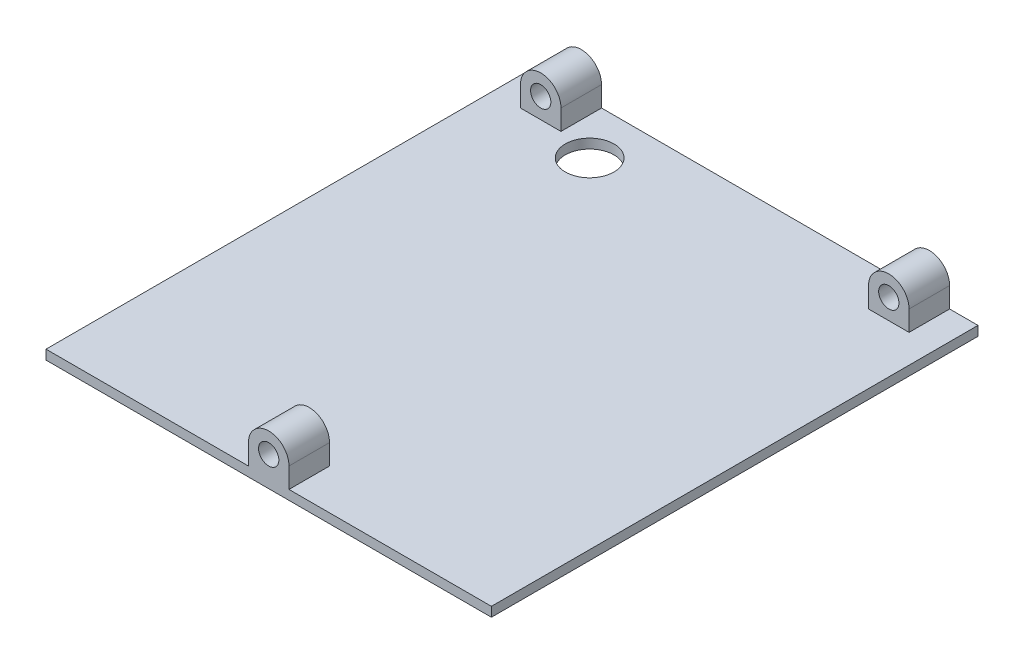
ISO-10303-21;
HEADER;
FILE_DESCRIPTION(('STEP AP214'),'2;1');
FILE_NAME('part.step','',(''),(''),'','','');
FILE_SCHEMA(('AUTOMOTIVE_DESIGN { 1 0 10303 214 1 1 1 1 }'));
ENDSEC;
DATA;
#1=APPLICATION_CONTEXT('core data for automotive mechanical design processes');
#2=APPLICATION_PROTOCOL_DEFINITION('international standard','automotive_design',2000,#1);
#3=PRODUCT_CONTEXT('',#1,'mechanical');
#4=PRODUCT('Part','Part','',(#3));
#5=PRODUCT_RELATED_PRODUCT_CATEGORY('part','',(#4));
#6=PRODUCT_DEFINITION_FORMATION('','',#4);
#7=PRODUCT_DEFINITION_CONTEXT('part definition',#1,'design');
#8=PRODUCT_DEFINITION('design','',#6,#7);
#9=PRODUCT_DEFINITION_SHAPE('','',#8);
#10=(LENGTH_UNIT() NAMED_UNIT(*) SI_UNIT(.MILLI.,.METRE.));
#11=(NAMED_UNIT(*) PLANE_ANGLE_UNIT() SI_UNIT($,.RADIAN.));
#12=(NAMED_UNIT(*) SI_UNIT($,.STERADIAN.) SOLID_ANGLE_UNIT());
#13=UNCERTAINTY_MEASURE_WITH_UNIT(LENGTH_MEASURE(1.E-05),#10,'distance_accuracy_value','');
#14=(GEOMETRIC_REPRESENTATION_CONTEXT(3) GLOBAL_UNCERTAINTY_ASSIGNED_CONTEXT((#13)) GLOBAL_UNIT_ASSIGNED_CONTEXT((#10,
#11,#12)) REPRESENTATION_CONTEXT('',''));
#15=CARTESIAN_POINT('',(0.,0.,0.));
#16=DIRECTION('',(0.,0.,1.));
#17=DIRECTION('',(1.,0.,0.));
#18=AXIS2_PLACEMENT_3D('',#15,#16,#17);
#19=CARTESIAN_POINT('',(0.,6.35,0.));
#20=DIRECTION('',(1.,0.,0.));
#21=DIRECTION('',(0.,0.,-1.));
#22=AXIS2_PLACEMENT_3D('',#19,#20,#21);
#23=PLANE('',#22);
#24=DIRECTION('',(0.,0.,1.));
#25=VECTOR('',#24,1.);
#26=CARTESIAN_POINT('',(0.,2.975,-152.4));
#27=LINE('',#26,#25);
#28=CARTESIAN_POINT('',(0.,2.975,-152.4));
#29=VERTEX_POINT('',#28);
#30=CARTESIAN_POINT('',(0.,2.975,0.));
#31=VERTEX_POINT('',#30);
#32=EDGE_CURVE('E290',#29,#31,#27,.T.);
#33=ORIENTED_EDGE('',*,*,#32,.F.);
#34=DIRECTION('',(0.,-1.,0.));
#35=VECTOR('',#34,1.);
#36=CARTESIAN_POINT('',(0.,6.35,-152.4));
#37=LINE('',#36,#35);
#38=CARTESIAN_POINT('',(0.,0.,-152.4));
#39=VERTEX_POINT('',#38);
#40=EDGE_CURVE('E331',#29,#39,#37,.T.);
#41=ORIENTED_EDGE('',*,*,#40,.T.);
#42=DIRECTION('',(0.,0.,1.));
#43=VECTOR('',#42,1.);
#44=CARTESIAN_POINT('',(0.,0.,0.));
#45=LINE('',#44,#43);
#46=CARTESIAN_POINT('',(0.,0.,0.));
#47=VERTEX_POINT('',#46);
#48=EDGE_CURVE('E314',#39,#47,#45,.T.);
#49=ORIENTED_EDGE('',*,*,#48,.T.);
#50=DIRECTION('',(0.,-1.,0.));
#51=VECTOR('',#50,1.);
#52=CARTESIAN_POINT('',(0.,6.35,0.));
#53=LINE('',#52,#51);
#54=EDGE_CURVE('E11',#31,#47,#53,.T.);
#55=ORIENTED_EDGE('',*,*,#54,.F.);
#56=EDGE_LOOP('',(#33,#41,#49,#55));
#57=FACE_BOUND('',#56,.T.);
#58=ADVANCED_FACE('F39',(#57),#23,.F.);
#59=CARTESIAN_POINT('',(0.,6.35,0.));
#60=DIRECTION('',(0.,0.,-1.));
#61=DIRECTION('',(-1.,0.,0.));
#62=AXIS2_PLACEMENT_3D('',#59,#60,#61);
#63=PLANE('',#62);
#64=DIRECTION('',(1.,0.,0.));
#65=VECTOR('',#64,1.);
#66=CARTESIAN_POINT('',(0.,2.975,0.));
#67=LINE('',#66,#65);
#68=CARTESIAN_POINT('',(63.4,2.975,0.));
#69=VERTEX_POINT('',#68);
#70=EDGE_CURVE('E303',#31,#69,#67,.T.);
#71=ORIENTED_EDGE('',*,*,#70,.F.);
#72=ORIENTED_EDGE('',*,*,#54,.T.);
#73=DIRECTION('',(1.,0.,0.));
#74=VECTOR('',#73,1.);
#75=CARTESIAN_POINT('',(0.,0.,0.));
#76=LINE('',#75,#74);
#77=CARTESIAN_POINT('',(139.5,0.,0.));
#78=VERTEX_POINT('',#77);
#79=EDGE_CURVE('E319',#47,#78,#76,.T.);
#80=ORIENTED_EDGE('',*,*,#79,.T.);
#81=DIRECTION('',(0.,-1.,0.));
#82=VECTOR('',#81,1.);
#83=CARTESIAN_POINT('',(139.5,6.35,0.));
#84=LINE('',#83,#82);
#85=CARTESIAN_POINT('',(139.5,2.975,0.));
#86=VERTEX_POINT('',#85);
#87=EDGE_CURVE('E48',#86,#78,#84,.T.);
#88=ORIENTED_EDGE('',*,*,#87,.F.);
#89=CARTESIAN_POINT('',(76.1,2.975,0.));
#90=VERTEX_POINT('',#89);
#91=EDGE_CURVE('E302',#90,#86,#67,.T.);
#92=ORIENTED_EDGE('',*,*,#91,.F.);
#93=DIRECTION('',(0.,1.,0.));
#94=VECTOR('',#93,1.);
#95=CARTESIAN_POINT('',(76.1,9.32500063341215,0.));
#96=LINE('',#95,#94);
#97=CARTESIAN_POINT('',(76.1,9.32500063341215,0.));
#98=VERTEX_POINT('',#97);
#99=EDGE_CURVE('E264',#90,#98,#96,.T.);
#100=ORIENTED_EDGE('',*,*,#99,.T.);
#101=CARTESIAN_POINT('',(69.75,9.32500031670607,0.));
#102=DIRECTION('',(0.,0.,1.));
#103=DIRECTION('',(1.,0.,0.));
#104=AXIS2_PLACEMENT_3D('',#101,#102,#103);
#105=CIRCLE('',#104,6.35);
#106=CARTESIAN_POINT('',(63.4,9.325,0.));
#107=VERTEX_POINT('',#106);
#108=EDGE_CURVE('E255',#98,#107,#105,.T.);
#109=ORIENTED_EDGE('',*,*,#108,.T.);
#110=DIRECTION('',(0.,-1.,0.));
#111=VECTOR('',#110,1.);
#112=CARTESIAN_POINT('',(63.4,9.325,0.));
#113=LINE('',#112,#111);
#114=EDGE_CURVE('E280',#107,#69,#113,.T.);
#115=ORIENTED_EDGE('',*,*,#114,.T.);
#116=EDGE_LOOP('',(#71,#72,#80,#88,#92,#100,#109,#115));
#117=FACE_BOUND('',#116,.T.);
#118=CARTESIAN_POINT('',(69.75,9.32500031670607,0.));
#119=DIRECTION('',(0.,0.,1.));
#120=DIRECTION('',(1.,0.,0.));
#121=AXIS2_PLACEMENT_3D('',#118,#119,#120);
#122=CIRCLE('',#121,3.17499999999998);
#123=CARTESIAN_POINT('',(72.925,9.32500031670607,0.));
#124=VERTEX_POINT('',#123);
#125=EDGE_CURVE('E240',#124,#124,#122,.T.);
#126=ORIENTED_EDGE('',*,*,#125,.F.);
#127=EDGE_LOOP('',(#126));
#128=FACE_BOUND('',#127,.T.);
#129=ADVANCED_FACE('F349',(#117,#128),#63,.F.);
#130=CARTESIAN_POINT('',(139.5,6.35,0.));
#131=DIRECTION('',(-1.,0.,0.));
#132=DIRECTION('',(0.,0.,1.));
#133=AXIS2_PLACEMENT_3D('',#130,#131,#132);
#134=PLANE('',#133);
#135=DIRECTION('',(0.,0.,-1.));
#136=VECTOR('',#135,1.);
#137=CARTESIAN_POINT('',(139.5,2.975,-152.4));
#138=LINE('',#137,#136);
#139=CARTESIAN_POINT('',(139.5,2.975,-152.4));
#140=VERTEX_POINT('',#139);
#141=EDGE_CURVE('E307',#86,#140,#138,.T.);
#142=ORIENTED_EDGE('',*,*,#141,.F.);
#143=ORIENTED_EDGE('',*,*,#87,.T.);
#144=DIRECTION('',(0.,0.,-1.));
#145=VECTOR('',#144,1.);
#146=CARTESIAN_POINT('',(139.5,0.,0.));
#147=LINE('',#146,#145);
#148=CARTESIAN_POINT('',(139.5,0.,-152.4));
#149=VERTEX_POINT('',#148);
#150=EDGE_CURVE('E323',#78,#149,#147,.T.);
#151=ORIENTED_EDGE('',*,*,#150,.T.);
#152=DIRECTION('',(0.,-1.,0.));
#153=VECTOR('',#152,1.);
#154=CARTESIAN_POINT('',(139.5,6.35,-152.4));
#155=LINE('',#154,#153);
#156=EDGE_CURVE('E334',#140,#149,#155,.T.);
#157=ORIENTED_EDGE('',*,*,#156,.F.);
#158=EDGE_LOOP('',(#142,#143,#151,#157));
#159=FACE_BOUND('',#158,.T.);
#160=ADVANCED_FACE('F341',(#159),#134,.F.);
#161=CARTESIAN_POINT('',(0.,6.35,-152.4));
#162=DIRECTION('',(0.,0.,1.));
#163=DIRECTION('',(1.,0.,0.));
#164=AXIS2_PLACEMENT_3D('',#161,#162,#163);
#165=PLANE('',#164);
#166=DIRECTION('',(-1.,0.,0.));
#167=VECTOR('',#166,1.);
#168=CARTESIAN_POINT('',(0.,2.975,-152.4));
#169=LINE('',#168,#167);
#170=CARTESIAN_POINT('',(130.61,2.975,-152.4));
#171=VERTEX_POINT('',#170);
#172=EDGE_CURVE('E311',#140,#171,#169,.T.);
#173=ORIENTED_EDGE('',*,*,#172,.F.);
#174=ORIENTED_EDGE('',*,*,#156,.T.);
#175=DIRECTION('',(-1.,0.,0.));
#176=VECTOR('',#175,1.);
#177=CARTESIAN_POINT('',(0.,0.,-152.4));
#178=LINE('',#177,#176);
#179=EDGE_CURVE('E327',#149,#39,#178,.T.);
#180=ORIENTED_EDGE('',*,*,#179,.T.);
#181=ORIENTED_EDGE('',*,*,#40,.F.);
#182=CARTESIAN_POINT('',(8.89,2.975,-152.4));
#183=VERTEX_POINT('',#182);
#184=EDGE_CURVE('E310',#183,#29,#169,.T.);
#185=ORIENTED_EDGE('',*,*,#184,.F.);
#186=DIRECTION('',(0.,1.,0.));
#187=VECTOR('',#186,1.);
#188=CARTESIAN_POINT('',(8.89,9.325,-152.4));
#189=LINE('',#188,#187);
#190=CARTESIAN_POINT('',(8.89,9.325,-152.4));
#191=VERTEX_POINT('',#190);
#192=EDGE_CURVE('E175',#183,#191,#189,.T.);
#193=ORIENTED_EDGE('',*,*,#192,.T.);
#194=CARTESIAN_POINT('',(15.24,9.325,-152.4));
#195=DIRECTION('',(0.,0.,-1.));
#196=DIRECTION('',(-1.,0.,0.));
#197=AXIS2_PLACEMENT_3D('',#194,#195,#196);
#198=CIRCLE('',#197,6.35);
#199=CARTESIAN_POINT('',(21.59,9.325,-152.4));
#200=VERTEX_POINT('',#199);
#201=EDGE_CURVE('E188',#191,#200,#198,.T.);
#202=ORIENTED_EDGE('',*,*,#201,.T.);
#203=DIRECTION('',(0.,-1.,0.));
#204=VECTOR('',#203,1.);
#205=CARTESIAN_POINT('',(21.59,9.325,-152.4));
#206=LINE('',#205,#204);
#207=CARTESIAN_POINT('',(21.59,2.975,-152.4));
#208=VERTEX_POINT('',#207);
#209=EDGE_CURVE('E156',#200,#208,#206,.T.);
#210=ORIENTED_EDGE('',*,*,#209,.T.);
#211=CARTESIAN_POINT('',(117.91,2.975,-152.4));
#212=VERTEX_POINT('',#211);
#213=EDGE_CURVE('E315',#212,#208,#169,.T.);
#214=ORIENTED_EDGE('',*,*,#213,.F.);
#215=DIRECTION('',(0.,1.,0.));
#216=VECTOR('',#215,1.);
#217=CARTESIAN_POINT('',(117.91,9.325,-152.4));
#218=LINE('',#217,#216);
#219=CARTESIAN_POINT('',(117.91,9.325,-152.4));
#220=VERTEX_POINT('',#219);
#221=EDGE_CURVE('E215',#212,#220,#218,.T.);
#222=ORIENTED_EDGE('',*,*,#221,.T.);
#223=CARTESIAN_POINT('',(124.26,9.325,-152.4));
#224=DIRECTION('',(0.,0.,-1.));
#225=DIRECTION('',(-1.,0.,0.));
#226=AXIS2_PLACEMENT_3D('',#223,#224,#225);
#227=CIRCLE('',#226,6.35);
#228=CARTESIAN_POINT('',(130.61,9.325,-152.4));
#229=VERTEX_POINT('',#228);
#230=EDGE_CURVE('E206',#220,#229,#227,.T.);
#231=ORIENTED_EDGE('',*,*,#230,.T.);
#232=DIRECTION('',(0.,-1.,0.));
#233=VECTOR('',#232,1.);
#234=CARTESIAN_POINT('',(130.61,9.325,-152.4));
#235=LINE('',#234,#233);
#236=EDGE_CURVE('E230',#229,#171,#235,.T.);
#237=ORIENTED_EDGE('',*,*,#236,.T.);
#238=EDGE_LOOP('',(#173,#174,#180,#181,#185,#193,#202,#210,#214,#222,#231,#237));
#239=FACE_BOUND('',#238,.T.);
#240=CARTESIAN_POINT('',(124.26,9.325,-152.4));
#241=DIRECTION('',(0.,0.,-1.));
#242=DIRECTION('',(-1.,0.,0.));
#243=AXIS2_PLACEMENT_3D('',#240,#241,#242);
#244=CIRCLE('',#243,3.17500000072341);
#245=CARTESIAN_POINT('',(121.084999999277,9.325,-152.4));
#246=VERTEX_POINT('',#245);
#247=EDGE_CURVE('E196',#246,#246,#244,.T.);
#248=ORIENTED_EDGE('',*,*,#247,.F.);
#249=EDGE_LOOP('',(#248));
#250=FACE_BOUND('',#249,.T.);
#251=CARTESIAN_POINT('',(15.24,9.325,-152.4));
#252=DIRECTION('',(0.,0.,-1.));
#253=DIRECTION('',(-1.,0.,0.));
#254=AXIS2_PLACEMENT_3D('',#251,#252,#253);
#255=CIRCLE('',#254,3.17500000036169);
#256=CARTESIAN_POINT('',(12.0649999996383,9.325,-152.4));
#257=VERTEX_POINT('',#256);
#258=EDGE_CURVE('E181',#257,#257,#255,.T.);
#259=ORIENTED_EDGE('',*,*,#258,.F.);
#260=EDGE_LOOP('',(#259));
#261=FACE_BOUND('',#260,.T.);
#262=ADVANCED_FACE('F358',(#239,#250,#261),#165,.F.);
#263=CARTESIAN_POINT('',(0.,0.,0.));
#264=DIRECTION('',(0.,-1.,0.));
#265=DIRECTION('',(0.,0.,-1.));
#266=AXIS2_PLACEMENT_3D('',#263,#264,#265);
#267=PLANE('',#266);
#268=CARTESIAN_POINT('',(33.274,0.,-136.991598));
#269=DIRECTION('',(0.,-1.,0.));
#270=DIRECTION('',(0.,0.,-1.));
#271=AXIS2_PLACEMENT_3D('',#268,#269,#270);
#272=CIRCLE('',#271,7.62);
#273=CARTESIAN_POINT('',(33.274,0.,-144.611598));
#274=VERTEX_POINT('',#273);
#275=EDGE_CURVE('E457',#274,#274,#272,.T.);
#276=ORIENTED_EDGE('',*,*,#275,.F.);
#277=EDGE_LOOP('',(#276));
#278=FACE_BOUND('',#277,.T.);
#279=ORIENTED_EDGE('',*,*,#48,.F.);
#280=ORIENTED_EDGE('',*,*,#179,.F.);
#281=ORIENTED_EDGE('',*,*,#150,.F.);
#282=ORIENTED_EDGE('',*,*,#79,.F.);
#283=EDGE_LOOP('',(#279,#280,#281,#282));
#284=FACE_BOUND('',#283,.T.);
#285=ADVANCED_FACE('F354',(#278,#284),#267,.T.);
#286=CARTESIAN_POINT('',(0.,2.975,0.));
#287=DIRECTION('',(0.,1.,0.));
#288=DIRECTION('',(0.,0.,1.));
#289=AXIS2_PLACEMENT_3D('',#286,#287,#288);
#290=PLANE('',#289);
#291=CARTESIAN_POINT('',(33.274,2.975,-136.991598));
#292=DIRECTION('',(0.,1.,0.));
#293=DIRECTION('',(0.,0.,1.));
#294=AXIS2_PLACEMENT_3D('',#291,#292,#293);
#295=CIRCLE('',#294,7.62);
#296=CARTESIAN_POINT('',(33.274,2.975,-129.371598));
#297=VERTEX_POINT('',#296);
#298=EDGE_CURVE('E42',#297,#297,#295,.T.);
#299=ORIENTED_EDGE('',*,*,#298,.F.);
#300=EDGE_LOOP('',(#299));
#301=FACE_BOUND('',#300,.T.);
#302=DIRECTION('',(0.,0.,-1.));
#303=VECTOR('',#302,1.);
#304=CARTESIAN_POINT('',(8.89,2.975,-139.7));
#305=LINE('',#304,#303);
#306=CARTESIAN_POINT('',(8.89,2.975,-139.7));
#307=VERTEX_POINT('',#306);
#308=EDGE_CURVE('E197',#307,#183,#305,.T.);
#309=ORIENTED_EDGE('',*,*,#308,.T.);
#310=ORIENTED_EDGE('',*,*,#184,.T.);
#311=ORIENTED_EDGE('',*,*,#32,.T.);
#312=ORIENTED_EDGE('',*,*,#70,.T.);
#313=DIRECTION('',(0.,0.,1.));
#314=VECTOR('',#313,1.);
#315=CARTESIAN_POINT('',(63.4,2.975,-12.7));
#316=LINE('',#315,#314);
#317=CARTESIAN_POINT('',(63.4,2.975,-12.7));
#318=VERTEX_POINT('',#317);
#319=EDGE_CURVE('E295',#318,#69,#316,.T.);
#320=ORIENTED_EDGE('',*,*,#319,.F.);
#321=DIRECTION('',(1.,0.,0.));
#322=VECTOR('',#321,1.);
#323=CARTESIAN_POINT('',(63.4,2.975,-12.7));
#324=LINE('',#323,#322);
#325=CARTESIAN_POINT('',(76.1,2.97500000000001,-12.7));
#326=VERTEX_POINT('',#325);
#327=EDGE_CURVE('E268',#318,#326,#324,.T.);
#328=ORIENTED_EDGE('',*,*,#327,.T.);
#329=DIRECTION('',(0.,0.,1.));
#330=VECTOR('',#329,1.);
#331=CARTESIAN_POINT('',(76.1,2.97500000000001,-12.7));
#332=LINE('',#331,#330);
#333=EDGE_CURVE('E291',#326,#90,#332,.T.);
#334=ORIENTED_EDGE('',*,*,#333,.T.);
#335=ORIENTED_EDGE('',*,*,#91,.T.);
#336=ORIENTED_EDGE('',*,*,#141,.T.);
#337=ORIENTED_EDGE('',*,*,#172,.T.);
#338=DIRECTION('',(0.,0.,-1.));
#339=VECTOR('',#338,1.);
#340=CARTESIAN_POINT('',(130.61,2.975,-139.7));
#341=LINE('',#340,#339);
#342=CARTESIAN_POINT('',(130.61,2.975,-139.7));
#343=VERTEX_POINT('',#342);
#344=EDGE_CURVE('E245',#343,#171,#341,.T.);
#345=ORIENTED_EDGE('',*,*,#344,.F.);
#346=DIRECTION('',(-1.,0.,0.));
#347=VECTOR('',#346,1.);
#348=CARTESIAN_POINT('',(130.61,2.975,-139.7));
#349=LINE('',#348,#347);
#350=CARTESIAN_POINT('',(117.91,2.975,-139.7));
#351=VERTEX_POINT('',#350);
#352=EDGE_CURVE('E219',#343,#351,#349,.T.);
#353=ORIENTED_EDGE('',*,*,#352,.T.);
#354=DIRECTION('',(0.,0.,-1.));
#355=VECTOR('',#354,1.);
#356=CARTESIAN_POINT('',(117.91,2.975,-139.7));
#357=LINE('',#356,#355);
#358=EDGE_CURVE('E241',#351,#212,#357,.T.);
#359=ORIENTED_EDGE('',*,*,#358,.T.);
#360=ORIENTED_EDGE('',*,*,#213,.T.);
#361=DIRECTION('',(0.,0.,-1.));
#362=VECTOR('',#361,1.);
#363=CARTESIAN_POINT('',(21.59,2.975,-139.7));
#364=LINE('',#363,#362);
#365=CARTESIAN_POINT('',(21.59,2.975,-139.7));
#366=VERTEX_POINT('',#365);
#367=EDGE_CURVE('E60',#366,#208,#364,.T.);
#368=ORIENTED_EDGE('',*,*,#367,.F.);
#369=DIRECTION('',(-1.,0.,0.));
#370=VECTOR('',#369,1.);
#371=CARTESIAN_POINT('',(21.59,2.975,-139.7));
#372=LINE('',#371,#370);
#373=EDGE_CURVE('E55',#366,#307,#372,.T.);
#374=ORIENTED_EDGE('',*,*,#373,.T.);
#375=EDGE_LOOP('',(#309,#310,#311,#312,#320,#328,#334,#335,#336,#337,#345,#353,#359,#360,#368,#374));
#376=FACE_BOUND('',#375,.T.);
#377=ADVANCED_FACE('F361',(#301,#376),#290,.T.);
#378=CARTESIAN_POINT('',(69.75,9.32500031670607,-12.7));
#379=DIRECTION('',(0.,0.,1.));
#380=DIRECTION('',(1.,0.,0.));
#381=AXIS2_PLACEMENT_3D('',#378,#379,#380);
#382=CYLINDRICAL_SURFACE('',#381,6.35);
#383=ORIENTED_EDGE('',*,*,#108,.F.);
#384=DIRECTION('',(0.,0.,1.));
#385=VECTOR('',#384,1.);
#386=CARTESIAN_POINT('',(76.1,9.32500063341215,-12.7));
#387=LINE('',#386,#385);
#388=CARTESIAN_POINT('',(76.1,9.32500063341215,-12.7));
#389=VERTEX_POINT('',#388);
#390=EDGE_CURVE('E287',#389,#98,#387,.T.);
#391=ORIENTED_EDGE('',*,*,#390,.F.);
#392=CARTESIAN_POINT('',(69.75,9.32500031670607,-12.7));
#393=DIRECTION('',(0.,0.,1.));
#394=DIRECTION('',(1.,0.,0.));
#395=AXIS2_PLACEMENT_3D('',#392,#393,#394);
#396=CIRCLE('',#395,6.35);
#397=CARTESIAN_POINT('',(63.4,9.325,-12.7));
#398=VERTEX_POINT('',#397);
#399=EDGE_CURVE('E259',#389,#398,#396,.T.);
#400=ORIENTED_EDGE('',*,*,#399,.T.);
#401=DIRECTION('',(0.,0.,1.));
#402=VECTOR('',#401,1.);
#403=CARTESIAN_POINT('',(63.4,9.325,-12.7));
#404=LINE('',#403,#402);
#405=EDGE_CURVE('E276',#398,#107,#404,.T.);
#406=ORIENTED_EDGE('',*,*,#405,.T.);
#407=EDGE_LOOP('',(#383,#391,#400,#406));
#408=FACE_BOUND('',#407,.T.);
#409=ADVANCED_FACE('F400',(#408),#382,.T.);
#410=CARTESIAN_POINT('',(76.1,9.32500063341215,-12.7));
#411=DIRECTION('',(1.,0.,0.));
#412=DIRECTION('',(0.,0.,-1.));
#413=AXIS2_PLACEMENT_3D('',#410,#411,#412);
#414=PLANE('',#413);
#415=ORIENTED_EDGE('',*,*,#99,.F.);
#416=ORIENTED_EDGE('',*,*,#333,.F.);
#417=DIRECTION('',(0.,1.,0.));
#418=VECTOR('',#417,1.);
#419=CARTESIAN_POINT('',(76.1,9.32500063341215,-12.7));
#420=LINE('',#419,#418);
#421=EDGE_CURVE('E272',#326,#389,#420,.T.);
#422=ORIENTED_EDGE('',*,*,#421,.T.);
#423=ORIENTED_EDGE('',*,*,#390,.T.);
#424=EDGE_LOOP('',(#415,#416,#422,#423));
#425=FACE_BOUND('',#424,.T.);
#426=ADVANCED_FACE('F404',(#425),#414,.T.);
#427=CARTESIAN_POINT('',(63.4,9.325,-12.7));
#428=DIRECTION('',(-1.,0.,0.));
#429=DIRECTION('',(0.,0.,1.));
#430=AXIS2_PLACEMENT_3D('',#427,#428,#429);
#431=PLANE('',#430);
#432=ORIENTED_EDGE('',*,*,#114,.F.);
#433=ORIENTED_EDGE('',*,*,#405,.F.);
#434=DIRECTION('',(0.,-1.,0.));
#435=VECTOR('',#434,1.);
#436=CARTESIAN_POINT('',(63.4,9.325,-12.7));
#437=LINE('',#436,#435);
#438=EDGE_CURVE('E263',#398,#318,#437,.T.);
#439=ORIENTED_EDGE('',*,*,#438,.T.);
#440=ORIENTED_EDGE('',*,*,#319,.T.);
#441=EDGE_LOOP('',(#432,#433,#439,#440));
#442=FACE_BOUND('',#441,.T.);
#443=ADVANCED_FACE('F406',(#442),#431,.T.);
#444=CARTESIAN_POINT('',(69.75,9.32500031670607,-12.7));
#445=DIRECTION('',(0.,0.,1.));
#446=DIRECTION('',(1.,0.,0.));
#447=AXIS2_PLACEMENT_3D('',#444,#445,#446);
#448=PLANE('',#447);
#449=CARTESIAN_POINT('',(69.75,9.32500031670607,-12.7));
#450=DIRECTION('',(0.,0.,1.));
#451=DIRECTION('',(1.,0.,0.));
#452=AXIS2_PLACEMENT_3D('',#449,#450,#451);
#453=CIRCLE('',#452,3.17499999999998);
#454=CARTESIAN_POINT('',(72.925,9.32500031670607,-12.7));
#455=VERTEX_POINT('',#454);
#456=EDGE_CURVE('E251',#455,#455,#453,.T.);
#457=ORIENTED_EDGE('',*,*,#456,.T.);
#458=EDGE_LOOP('',(#457));
#459=FACE_BOUND('',#458,.T.);
#460=ORIENTED_EDGE('',*,*,#399,.F.);
#461=ORIENTED_EDGE('',*,*,#421,.F.);
#462=ORIENTED_EDGE('',*,*,#327,.F.);
#463=ORIENTED_EDGE('',*,*,#438,.F.);
#464=EDGE_LOOP('',(#460,#461,#462,#463));
#465=FACE_BOUND('',#464,.T.);
#466=ADVANCED_FACE('F409',(#459,#465),#448,.F.);
#467=CARTESIAN_POINT('',(69.75,9.32500031670607,-12.7));
#468=DIRECTION('',(0.,0.,1.));
#469=DIRECTION('',(1.,0.,0.));
#470=AXIS2_PLACEMENT_3D('',#467,#468,#469);
#471=CYLINDRICAL_SURFACE('',#470,3.17499999999998);
#472=ORIENTED_EDGE('',*,*,#456,.F.);
#473=EDGE_LOOP('',(#472));
#474=FACE_BOUND('',#473,.T.);
#475=ORIENTED_EDGE('',*,*,#125,.T.);
#476=EDGE_LOOP('',(#475));
#477=FACE_BOUND('',#476,.T.);
#478=ADVANCED_FACE('F416',(#474,#477),#471,.F.);
#479=CARTESIAN_POINT('',(124.26,9.325,-139.7));
#480=DIRECTION('',(0.,0.,-1.));
#481=DIRECTION('',(-1.,0.,0.));
#482=AXIS2_PLACEMENT_3D('',#479,#480,#481);
#483=CYLINDRICAL_SURFACE('',#482,6.35);
#484=ORIENTED_EDGE('',*,*,#230,.F.);
#485=DIRECTION('',(0.,0.,-1.));
#486=VECTOR('',#485,1.);
#487=CARTESIAN_POINT('',(117.91,9.325,-139.7));
#488=LINE('',#487,#486);
#489=CARTESIAN_POINT('',(117.91,9.325,-139.7));
#490=VERTEX_POINT('',#489);
#491=EDGE_CURVE('E237',#490,#220,#488,.T.);
#492=ORIENTED_EDGE('',*,*,#491,.F.);
#493=CARTESIAN_POINT('',(124.26,9.325,-139.7));
#494=DIRECTION('',(0.,0.,-1.));
#495=DIRECTION('',(-1.,0.,0.));
#496=AXIS2_PLACEMENT_3D('',#493,#494,#495);
#497=CIRCLE('',#496,6.35);
#498=CARTESIAN_POINT('',(130.61,9.325,-139.7));
#499=VERTEX_POINT('',#498);
#500=EDGE_CURVE('E210',#490,#499,#497,.T.);
#501=ORIENTED_EDGE('',*,*,#500,.T.);
#502=DIRECTION('',(0.,0.,-1.));
#503=VECTOR('',#502,1.);
#504=CARTESIAN_POINT('',(130.61,9.325,-139.7));
#505=LINE('',#504,#503);
#506=EDGE_CURVE('E226',#499,#229,#505,.T.);
#507=ORIENTED_EDGE('',*,*,#506,.T.);
#508=EDGE_LOOP('',(#484,#492,#501,#507));
#509=FACE_BOUND('',#508,.T.);
#510=ADVANCED_FACE('F372',(#509),#483,.T.);
#511=CARTESIAN_POINT('',(117.91,9.325,-139.7));
#512=DIRECTION('',(-1.,0.,0.));
#513=DIRECTION('',(0.,0.,1.));
#514=AXIS2_PLACEMENT_3D('',#511,#512,#513);
#515=PLANE('',#514);
#516=ORIENTED_EDGE('',*,*,#221,.F.);
#517=ORIENTED_EDGE('',*,*,#358,.F.);
#518=DIRECTION('',(0.,1.,0.));
#519=VECTOR('',#518,1.);
#520=CARTESIAN_POINT('',(117.91,9.325,-139.7));
#521=LINE('',#520,#519);
#522=EDGE_CURVE('E222',#351,#490,#521,.T.);
#523=ORIENTED_EDGE('',*,*,#522,.T.);
#524=ORIENTED_EDGE('',*,*,#491,.T.);
#525=EDGE_LOOP('',(#516,#517,#523,#524));
#526=FACE_BOUND('',#525,.T.);
#527=ADVANCED_FACE('F375',(#526),#515,.T.);
#528=CARTESIAN_POINT('',(130.61,9.325,-139.7));
#529=DIRECTION('',(1.,0.,0.));
#530=DIRECTION('',(0.,0.,-1.));
#531=AXIS2_PLACEMENT_3D('',#528,#529,#530);
#532=PLANE('',#531);
#533=ORIENTED_EDGE('',*,*,#236,.F.);
#534=ORIENTED_EDGE('',*,*,#506,.F.);
#535=DIRECTION('',(0.,-1.,0.));
#536=VECTOR('',#535,1.);
#537=CARTESIAN_POINT('',(130.61,9.325,-139.7));
#538=LINE('',#537,#536);
#539=EDGE_CURVE('E214',#499,#343,#538,.T.);
#540=ORIENTED_EDGE('',*,*,#539,.T.);
#541=ORIENTED_EDGE('',*,*,#344,.T.);
#542=EDGE_LOOP('',(#533,#534,#540,#541));
#543=FACE_BOUND('',#542,.T.);
#544=ADVANCED_FACE('F364',(#543),#532,.T.);
#545=CARTESIAN_POINT('',(124.26,9.325,-139.7));
#546=DIRECTION('',(0.,0.,-1.));
#547=DIRECTION('',(-1.,0.,0.));
#548=AXIS2_PLACEMENT_3D('',#545,#546,#547);
#549=PLANE('',#548);
#550=CARTESIAN_POINT('',(124.26,9.325,-139.7));
#551=DIRECTION('',(0.,0.,-1.));
#552=DIRECTION('',(-1.,0.,0.));
#553=AXIS2_PLACEMENT_3D('',#550,#551,#552);
#554=CIRCLE('',#553,3.17500000072341);
#555=CARTESIAN_POINT('',(121.084999999277,9.325,-139.7));
#556=VERTEX_POINT('',#555);
#557=EDGE_CURVE('E202',#556,#556,#554,.T.);
#558=ORIENTED_EDGE('',*,*,#557,.T.);
#559=EDGE_LOOP('',(#558));
#560=FACE_BOUND('',#559,.T.);
#561=ORIENTED_EDGE('',*,*,#500,.F.);
#562=ORIENTED_EDGE('',*,*,#522,.F.);
#563=ORIENTED_EDGE('',*,*,#352,.F.);
#564=ORIENTED_EDGE('',*,*,#539,.F.);
#565=EDGE_LOOP('',(#561,#562,#563,#564));
#566=FACE_BOUND('',#565,.T.);
#567=ADVANCED_FACE('F368',(#560,#566),#549,.F.);
#568=CARTESIAN_POINT('',(124.26,9.325,-139.7));
#569=DIRECTION('',(0.,0.,-1.));
#570=DIRECTION('',(-1.,0.,0.));
#571=AXIS2_PLACEMENT_3D('',#568,#569,#570);
#572=CYLINDRICAL_SURFACE('',#571,3.17500000072341);
#573=ORIENTED_EDGE('',*,*,#557,.F.);
#574=EDGE_LOOP('',(#573));
#575=FACE_BOUND('',#574,.T.);
#576=ORIENTED_EDGE('',*,*,#247,.T.);
#577=EDGE_LOOP('',(#576));
#578=FACE_BOUND('',#577,.T.);
#579=ADVANCED_FACE('F429',(#575,#578),#572,.F.);
#580=CARTESIAN_POINT('',(15.24,9.325,-139.7));
#581=DIRECTION('',(0.,0.,-1.));
#582=DIRECTION('',(-1.,0.,0.));
#583=AXIS2_PLACEMENT_3D('',#580,#581,#582);
#584=CYLINDRICAL_SURFACE('',#583,6.35);
#585=ORIENTED_EDGE('',*,*,#201,.F.);
#586=DIRECTION('',(0.,0.,-1.));
#587=VECTOR('',#586,1.);
#588=CARTESIAN_POINT('',(8.89,9.325,-139.7));
#589=LINE('',#588,#587);
#590=CARTESIAN_POINT('',(8.89,9.325,-139.7));
#591=VERTEX_POINT('',#590);
#592=EDGE_CURVE('E173',#591,#191,#589,.T.);
#593=ORIENTED_EDGE('',*,*,#592,.F.);
#594=CARTESIAN_POINT('',(15.24,9.325,-139.7));
#595=DIRECTION('',(0.,0.,-1.));
#596=DIRECTION('',(-1.,0.,0.));
#597=AXIS2_PLACEMENT_3D('',#594,#595,#596);
#598=CIRCLE('',#597,6.35);
#599=CARTESIAN_POINT('',(21.59,9.325,-139.7));
#600=VERTEX_POINT('',#599);
#601=EDGE_CURVE('E168',#591,#600,#598,.T.);
#602=ORIENTED_EDGE('',*,*,#601,.T.);
#603=DIRECTION('',(0.,0.,-1.));
#604=VECTOR('',#603,1.);
#605=CARTESIAN_POINT('',(21.59,9.325,-139.7));
#606=LINE('',#605,#604);
#607=EDGE_CURVE('E151',#600,#200,#606,.T.);
#608=ORIENTED_EDGE('',*,*,#607,.T.);
#609=EDGE_LOOP('',(#585,#593,#602,#608));
#610=FACE_BOUND('',#609,.T.);
#611=ADVANCED_FACE('F172',(#610),#584,.T.);
#612=CARTESIAN_POINT('',(8.89,9.325,-139.7));
#613=DIRECTION('',(-1.,0.,0.));
#614=DIRECTION('',(0.,-1.,0.));
#615=AXIS2_PLACEMENT_3D('',#612,#613,#614);
#616=PLANE('',#615);
#617=ORIENTED_EDGE('',*,*,#192,.F.);
#618=ORIENTED_EDGE('',*,*,#308,.F.);
#619=DIRECTION('',(0.,1.,0.));
#620=VECTOR('',#619,1.);
#621=CARTESIAN_POINT('',(8.89,9.325,-139.7));
#622=LINE('',#621,#620);
#623=EDGE_CURVE('E162',#307,#591,#622,.T.);
#624=ORIENTED_EDGE('',*,*,#623,.T.);
#625=ORIENTED_EDGE('',*,*,#592,.T.);
#626=EDGE_LOOP('',(#617,#618,#624,#625));
#627=FACE_BOUND('',#626,.T.);
#628=ADVANCED_FACE('F380',(#627),#616,.T.);
#629=CARTESIAN_POINT('',(21.59,9.325,-139.7));
#630=DIRECTION('',(1.,0.,0.));
#631=DIRECTION('',(0.,1.,0.));
#632=AXIS2_PLACEMENT_3D('',#629,#630,#631);
#633=PLANE('',#632);
#634=ORIENTED_EDGE('',*,*,#209,.F.);
#635=ORIENTED_EDGE('',*,*,#607,.F.);
#636=DIRECTION('',(0.,-1.,0.));
#637=VECTOR('',#636,1.);
#638=CARTESIAN_POINT('',(21.59,9.325,-139.7));
#639=LINE('',#638,#637);
#640=EDGE_CURVE('E154',#600,#366,#639,.T.);
#641=ORIENTED_EDGE('',*,*,#640,.T.);
#642=ORIENTED_EDGE('',*,*,#367,.T.);
#643=EDGE_LOOP('',(#634,#635,#641,#642));
#644=FACE_BOUND('',#643,.T.);
#645=ADVANCED_FACE('F153',(#644),#633,.T.);
#646=CARTESIAN_POINT('',(15.24,9.325,-139.7));
#647=DIRECTION('',(0.,0.,-1.));
#648=DIRECTION('',(-1.,0.,0.));
#649=AXIS2_PLACEMENT_3D('',#646,#647,#648);
#650=PLANE('',#649);
#651=CARTESIAN_POINT('',(15.24,9.325,-139.7));
#652=DIRECTION('',(0.,0.,-1.));
#653=DIRECTION('',(-1.,0.,0.));
#654=AXIS2_PLACEMENT_3D('',#651,#652,#653);
#655=CIRCLE('',#654,3.17500000036169);
#656=CARTESIAN_POINT('',(12.0649999996383,9.325,-139.7));
#657=VERTEX_POINT('',#656);
#658=EDGE_CURVE('E191',#657,#657,#655,.T.);
#659=ORIENTED_EDGE('',*,*,#658,.T.);
#660=EDGE_LOOP('',(#659));
#661=FACE_BOUND('',#660,.T.);
#662=ORIENTED_EDGE('',*,*,#601,.F.);
#663=ORIENTED_EDGE('',*,*,#623,.F.);
#664=ORIENTED_EDGE('',*,*,#373,.F.);
#665=ORIENTED_EDGE('',*,*,#640,.F.);
#666=EDGE_LOOP('',(#662,#663,#664,#665));
#667=FACE_BOUND('',#666,.T.);
#668=ADVANCED_FACE('F166',(#661,#667),#650,.F.);
#669=CARTESIAN_POINT('',(15.24,9.325,-139.7));
#670=DIRECTION('',(0.,0.,-1.));
#671=DIRECTION('',(-1.,0.,0.));
#672=AXIS2_PLACEMENT_3D('',#669,#670,#671);
#673=CYLINDRICAL_SURFACE('',#672,3.17500000036169);
#674=ORIENTED_EDGE('',*,*,#658,.F.);
#675=EDGE_LOOP('',(#674));
#676=FACE_BOUND('',#675,.T.);
#677=ORIENTED_EDGE('',*,*,#258,.T.);
#678=EDGE_LOOP('',(#677));
#679=FACE_BOUND('',#678,.T.);
#680=ADVANCED_FACE('F442',(#676,#679),#673,.F.);
#681=CARTESIAN_POINT('',(33.274,15.6750003167061,-136.991598));
#682=DIRECTION('',(0.,-1.,0.));
#683=DIRECTION('',(0.,0.,-1.));
#684=AXIS2_PLACEMENT_3D('',#681,#682,#683);
#685=CYLINDRICAL_SURFACE('',#684,7.62);
#686=ORIENTED_EDGE('',*,*,#298,.T.);
#687=EDGE_LOOP('',(#686));
#688=FACE_BOUND('',#687,.T.);
#689=ORIENTED_EDGE('',*,*,#275,.T.);
#690=EDGE_LOOP('',(#689));
#691=FACE_BOUND('',#690,.T.);
#692=ADVANCED_FACE('F446',(#688,#691),#685,.F.);
#693=CLOSED_SHELL('',(#58,#129,#160,#262,#285,#377,#409,#426,#443,#466,#478,#510,#527,#544,#567,
#579,#611,#628,#645,#668,#680,#692));
#694=MANIFOLD_SOLID_BREP('B2',#693);
#695=ADVANCED_BREP_SHAPE_REPRESENTATION('',(#18,#694),#14);
#696=SHAPE_DEFINITION_REPRESENTATION(#9,#695);
ENDSEC;
END-ISO-10303-21;
